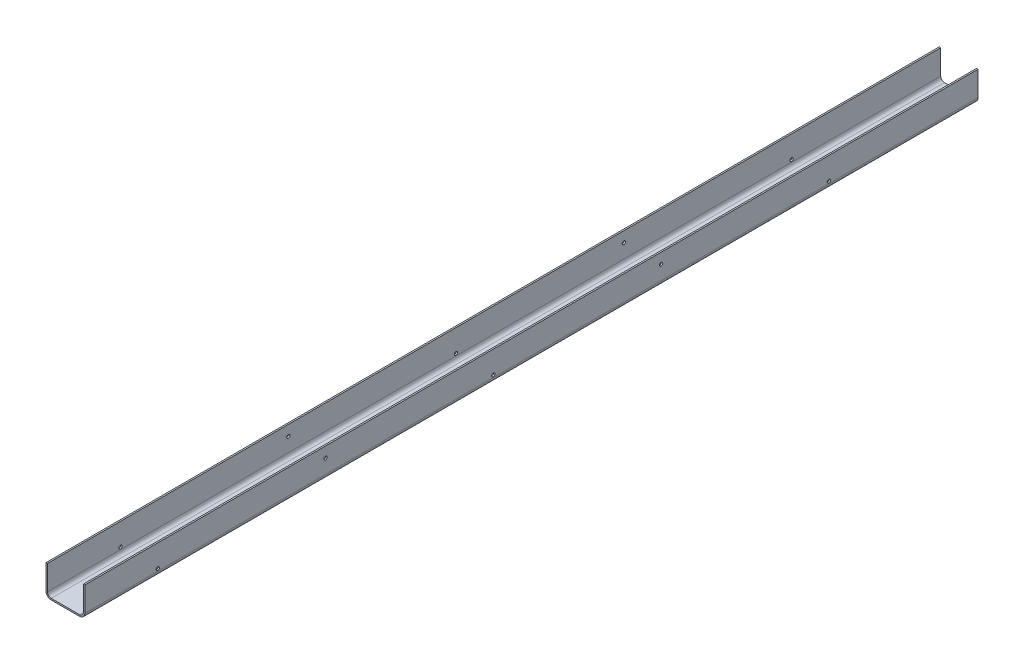
ISO-10303-21;
HEADER;
FILE_DESCRIPTION(('STEP AP214'),'2;1');
FILE_NAME('part.step','',(''),(''),'','','');
FILE_SCHEMA(('AUTOMOTIVE_DESIGN { 1 0 10303 214 1 1 1 1 }'));
ENDSEC;
DATA;
#1=APPLICATION_CONTEXT('core data for automotive mechanical design processes');
#2=APPLICATION_PROTOCOL_DEFINITION('international standard','automotive_design',2000,#1);
#3=PRODUCT_CONTEXT('',#1,'mechanical');
#4=PRODUCT('Part','Part','',(#3));
#5=PRODUCT_RELATED_PRODUCT_CATEGORY('part','',(#4));
#6=PRODUCT_DEFINITION_FORMATION('','',#4);
#7=PRODUCT_DEFINITION_CONTEXT('part definition',#1,'design');
#8=PRODUCT_DEFINITION('design','',#6,#7);
#9=PRODUCT_DEFINITION_SHAPE('','',#8);
#10=(LENGTH_UNIT() NAMED_UNIT(*) SI_UNIT(.MILLI.,.METRE.));
#11=(NAMED_UNIT(*) PLANE_ANGLE_UNIT() SI_UNIT($,.RADIAN.));
#12=(NAMED_UNIT(*) SI_UNIT($,.STERADIAN.) SOLID_ANGLE_UNIT());
#13=UNCERTAINTY_MEASURE_WITH_UNIT(LENGTH_MEASURE(1.E-05),#10,'distance_accuracy_value','');
#14=(GEOMETRIC_REPRESENTATION_CONTEXT(3) GLOBAL_UNCERTAINTY_ASSIGNED_CONTEXT((#13)) GLOBAL_UNIT_ASSIGNED_CONTEXT((#10,
#11,#12)) REPRESENTATION_CONTEXT('',''));
#15=CARTESIAN_POINT('',(0.,0.,0.));
#16=DIRECTION('',(0.,0.,1.));
#17=DIRECTION('',(1.,0.,0.));
#18=AXIS2_PLACEMENT_3D('',#15,#16,#17);
#19=CARTESIAN_POINT('',(0.,-165.,0.));
#20=DIRECTION('',(0.,0.,-1.));
#21=DIRECTION('',(-1.,0.,0.));
#22=AXIS2_PLACEMENT_3D('',#19,#20,#21);
#23=PLANE('',#22);
#24=DIRECTION('',(-1.,0.,0.));
#25=VECTOR('',#24,1.);
#26=CARTESIAN_POINT('',(0.,-165.,0.));
#27=LINE('',#26,#25);
#28=CARTESIAN_POINT('',(0.,-165.,0.));
#29=VERTEX_POINT('',#28);
#30=CARTESIAN_POINT('',(-10.,-165.,0.));
#31=VERTEX_POINT('',#30);
#32=EDGE_CURVE('E46',#29,#31,#27,.T.);
#33=ORIENTED_EDGE('',*,*,#32,.F.);
#34=CARTESIAN_POINT('',(25.,-165.,0.));
#35=DIRECTION('',(0.,0.,-1.));
#36=DIRECTION('',(-1.,0.,0.));
#37=AXIS2_PLACEMENT_3D('',#34,#35,#36);
#38=CIRCLE('',#37,25.);
#39=CARTESIAN_POINT('',(25.,-190.,0.));
#40=VERTEX_POINT('',#39);
#41=EDGE_CURVE('E288',#29,#40,#38,.F.);
#42=ORIENTED_EDGE('',*,*,#41,.T.);
#43=DIRECTION('',(0.,1.,0.));
#44=VECTOR('',#43,1.);
#45=CARTESIAN_POINT('',(25.,-200.,0.));
#46=LINE('',#45,#44);
#47=CARTESIAN_POINT('',(25.,-200.,0.));
#48=VERTEX_POINT('',#47);
#49=EDGE_CURVE('E176',#48,#40,#46,.T.);
#50=ORIENTED_EDGE('',*,*,#49,.F.);
#51=CARTESIAN_POINT('',(25.,-165.,0.));
#52=DIRECTION('',(0.,0.,1.));
#53=DIRECTION('',(1.,0.,0.));
#54=AXIS2_PLACEMENT_3D('',#51,#52,#53);
#55=CIRCLE('',#54,35.);
#56=EDGE_CURVE('E190',#31,#48,#55,.T.);
#57=ORIENTED_EDGE('',*,*,#56,.F.);
#58=EDGE_LOOP('',(#33,#42,#50,#57));
#59=FACE_BOUND('',#58,.T.);
#60=ADVANCED_FACE('F39',(#59),#23,.T.);
#61=CARTESIAN_POINT('',(25.,-200.,0.));
#62=DIRECTION('',(0.,0.,-1.));
#63=DIRECTION('',(-1.,0.,0.));
#64=AXIS2_PLACEMENT_3D('',#61,#62,#63);
#65=PLANE('',#64);
#66=DIRECTION('',(0.,-1.,0.));
#67=VECTOR('',#66,1.);
#68=CARTESIAN_POINT('',(0.,0.,0.));
#69=LINE('',#68,#67);
#70=CARTESIAN_POINT('',(0.,0.,0.));
#71=VERTEX_POINT('',#70);
#72=EDGE_CURVE('E185',#71,#29,#69,.T.);
#73=ORIENTED_EDGE('',*,*,#72,.T.);
#74=ORIENTED_EDGE('',*,*,#32,.T.);
#75=DIRECTION('',(0.,1.,0.));
#76=VECTOR('',#75,1.);
#77=CARTESIAN_POINT('',(-10.,0.,0.));
#78=LINE('',#77,#76);
#79=CARTESIAN_POINT('',(-10.,0.,0.));
#80=VERTEX_POINT('',#79);
#81=EDGE_CURVE('E183',#80,#31,#78,.F.);
#82=ORIENTED_EDGE('',*,*,#81,.F.);
#83=DIRECTION('',(1.,0.,0.));
#84=VECTOR('',#83,1.);
#85=CARTESIAN_POINT('',(-10.,0.,0.));
#86=LINE('',#85,#84);
#87=EDGE_CURVE('E150',#80,#71,#86,.T.);
#88=ORIENTED_EDGE('',*,*,#87,.T.);
#89=EDGE_LOOP('',(#73,#74,#82,#88));
#90=FACE_BOUND('',#89,.T.);
#91=ADVANCED_FACE('F182',(#90),#65,.T.);
#92=CARTESIAN_POINT('',(215.,-190.,0.));
#93=DIRECTION('',(0.,0.,-1.));
#94=DIRECTION('',(-1.,0.,0.));
#95=AXIS2_PLACEMENT_3D('',#92,#93,#94);
#96=PLANE('',#95);
#97=DIRECTION('',(0.,-1.,0.));
#98=VECTOR('',#97,1.);
#99=CARTESIAN_POINT('',(215.,-190.,0.));
#100=LINE('',#99,#98);
#101=CARTESIAN_POINT('',(215.,-190.,0.));
#102=VERTEX_POINT('',#101);
#103=CARTESIAN_POINT('',(215.,-200.,0.));
#104=VERTEX_POINT('',#103);
#105=EDGE_CURVE('E173',#102,#104,#100,.T.);
#106=ORIENTED_EDGE('',*,*,#105,.F.);
#107=CARTESIAN_POINT('',(215.,-165.,0.));
#108=DIRECTION('',(0.,0.,-1.));
#109=DIRECTION('',(-1.,0.,0.));
#110=AXIS2_PLACEMENT_3D('',#107,#108,#109);
#111=CIRCLE('',#110,25.);
#112=CARTESIAN_POINT('',(240.,-165.,0.));
#113=VERTEX_POINT('',#112);
#114=EDGE_CURVE('E282',#102,#113,#111,.F.);
#115=ORIENTED_EDGE('',*,*,#114,.T.);
#116=DIRECTION('',(-1.,0.,0.));
#117=VECTOR('',#116,1.);
#118=CARTESIAN_POINT('',(250.,-165.,0.));
#119=LINE('',#118,#117);
#120=CARTESIAN_POINT('',(250.,-165.,0.));
#121=VERTEX_POINT('',#120);
#122=EDGE_CURVE('E170',#121,#113,#119,.T.);
#123=ORIENTED_EDGE('',*,*,#122,.F.);
#124=CARTESIAN_POINT('',(215.,-165.,0.));
#125=DIRECTION('',(0.,0.,1.));
#126=DIRECTION('',(1.,0.,0.));
#127=AXIS2_PLACEMENT_3D('',#124,#125,#126);
#128=CIRCLE('',#127,35.);
#129=EDGE_CURVE('E200',#104,#121,#128,.T.);
#130=ORIENTED_EDGE('',*,*,#129,.F.);
#131=EDGE_LOOP('',(#106,#115,#123,#130));
#132=FACE_BOUND('',#131,.T.);
#133=ADVANCED_FACE('F307',(#132),#96,.T.);
#134=CARTESIAN_POINT('',(250.,-165.,0.));
#135=DIRECTION('',(0.,0.,-1.));
#136=DIRECTION('',(-1.,0.,0.));
#137=AXIS2_PLACEMENT_3D('',#134,#135,#136);
#138=PLANE('',#137);
#139=DIRECTION('',(1.,0.,0.));
#140=VECTOR('',#139,1.);
#141=CARTESIAN_POINT('',(0.,-190.,0.));
#142=LINE('',#141,#140);
#143=EDGE_CURVE('E285',#40,#102,#142,.T.);
#144=ORIENTED_EDGE('',*,*,#143,.T.);
#145=ORIENTED_EDGE('',*,*,#105,.T.);
#146=DIRECTION('',(1.,0.,0.));
#147=VECTOR('',#146,1.);
#148=CARTESIAN_POINT('',(0.,-200.,0.));
#149=LINE('',#148,#147);
#150=EDGE_CURVE('E197',#48,#104,#149,.T.);
#151=ORIENTED_EDGE('',*,*,#150,.F.);
#152=ORIENTED_EDGE('',*,*,#49,.T.);
#153=EDGE_LOOP('',(#144,#145,#151,#152));
#154=FACE_BOUND('',#153,.T.);
#155=ADVANCED_FACE('F299',(#154),#138,.T.);
#156=CARTESIAN_POINT('',(250.,-190.,6500.));
#157=DIRECTION('',(-1.,0.,0.));
#158=DIRECTION('',(0.,0.,1.));
#159=AXIS2_PLACEMENT_3D('',#156,#157,#158);
#160=PLANE('',#159);
#161=CARTESIAN_POINT('',(250.,-150.,1000.));
#162=DIRECTION('',(-1.,0.,0.));
#163=DIRECTION('',(0.,0.,1.));
#164=AXIS2_PLACEMENT_3D('',#161,#162,#163);
#165=CIRCLE('',#164,11.);
#166=CARTESIAN_POINT('',(250.,-150.,1011.));
#167=VERTEX_POINT('',#166);
#168=EDGE_CURVE('E271',#167,#167,#165,.T.);
#169=ORIENTED_EDGE('',*,*,#168,.T.);
#170=EDGE_LOOP('',(#169));
#171=FACE_BOUND('',#170,.T.);
#172=CARTESIAN_POINT('',(250.,-150.,3250.));
#173=DIRECTION('',(-1.,0.,0.));
#174=DIRECTION('',(0.,0.,1.));
#175=AXIS2_PLACEMENT_3D('',#172,#173,#174);
#176=CIRCLE('',#175,11.0000000000001);
#177=CARTESIAN_POINT('',(250.,-150.,3261.));
#178=VERTEX_POINT('',#177);
#179=EDGE_CURVE('E262',#178,#178,#176,.T.);
#180=ORIENTED_EDGE('',*,*,#179,.T.);
#181=EDGE_LOOP('',(#180));
#182=FACE_BOUND('',#181,.T.);
#183=CARTESIAN_POINT('',(250.,-150.,5500.));
#184=DIRECTION('',(-1.,0.,0.));
#185=DIRECTION('',(0.,0.,1.));
#186=AXIS2_PLACEMENT_3D('',#183,#184,#185);
#187=CIRCLE('',#186,10.9999999999997);
#188=CARTESIAN_POINT('',(250.,-150.,5511.));
#189=VERTEX_POINT('',#188);
#190=EDGE_CURVE('E253',#189,#189,#187,.T.);
#191=ORIENTED_EDGE('',*,*,#190,.T.);
#192=EDGE_LOOP('',(#191));
#193=FACE_BOUND('',#192,.T.);
#194=CARTESIAN_POINT('',(250.,-70.,2125.));
#195=DIRECTION('',(-1.,0.,0.));
#196=DIRECTION('',(0.,0.,1.));
#197=AXIS2_PLACEMENT_3D('',#194,#195,#196);
#198=CIRCLE('',#197,11.0000000000001);
#199=CARTESIAN_POINT('',(250.,-70.,2136.));
#200=VERTEX_POINT('',#199);
#201=EDGE_CURVE('E244',#200,#200,#198,.T.);
#202=ORIENTED_EDGE('',*,*,#201,.T.);
#203=EDGE_LOOP('',(#202));
#204=FACE_BOUND('',#203,.T.);
#205=CARTESIAN_POINT('',(250.,-70.,4375.));
#206=DIRECTION('',(-1.,0.,0.));
#207=DIRECTION('',(0.,0.,1.));
#208=AXIS2_PLACEMENT_3D('',#205,#206,#207);
#209=CIRCLE('',#208,10.9999999999997);
#210=CARTESIAN_POINT('',(250.,-70.,4386.));
#211=VERTEX_POINT('',#210);
#212=EDGE_CURVE('E235',#211,#211,#209,.T.);
#213=ORIENTED_EDGE('',*,*,#212,.T.);
#214=EDGE_LOOP('',(#213));
#215=FACE_BOUND('',#214,.T.);
#216=DIRECTION('',(0.,0.,-1.));
#217=VECTOR('',#216,1.);
#218=CARTESIAN_POINT('',(250.,0.,6500.));
#219=LINE('',#218,#217);
#220=CARTESIAN_POINT('',(250.,0.,5990.));
#221=VERTEX_POINT('',#220);
#222=CARTESIAN_POINT('',(250.,0.,0.));
#223=VERTEX_POINT('',#222);
#224=EDGE_CURVE('E168',#221,#223,#219,.T.);
#225=ORIENTED_EDGE('',*,*,#224,.F.);
#226=DIRECTION('',(0.,-1.,0.));
#227=VECTOR('',#226,1.);
#228=CARTESIAN_POINT('',(250.,-190.,5990.));
#229=LINE('',#228,#227);
#230=CARTESIAN_POINT('',(250.,-165.,5990.));
#231=VERTEX_POINT('',#230);
#232=EDGE_CURVE('E214',#221,#231,#229,.T.);
#233=ORIENTED_EDGE('',*,*,#232,.T.);
#234=DIRECTION('',(0.,0.,-1.));
#235=VECTOR('',#234,1.);
#236=CARTESIAN_POINT('',(250.,-165.,6500.));
#237=LINE('',#236,#235);
#238=EDGE_CURVE('E60',#231,#121,#237,.T.);
#239=ORIENTED_EDGE('',*,*,#238,.T.);
#240=DIRECTION('',(0.,1.,0.));
#241=VECTOR('',#240,1.);
#242=CARTESIAN_POINT('',(250.,-190.,0.));
#243=LINE('',#242,#241);
#244=EDGE_CURVE('E274',#121,#223,#243,.T.);
#245=ORIENTED_EDGE('',*,*,#244,.T.);
#246=EDGE_LOOP('',(#225,#233,#239,#245));
#247=FACE_BOUND('',#246,.T.);
#248=ADVANCED_FACE('F323',(#171,#182,#193,#204,#215,#247),#160,.F.);
#249=CARTESIAN_POINT('',(240.,0.,6500.));
#250=DIRECTION('',(0.,1.,0.));
#251=DIRECTION('',(0.,0.,1.));
#252=AXIS2_PLACEMENT_3D('',#249,#250,#251);
#253=PLANE('',#252);
#254=DIRECTION('',(1.,0.,0.));
#255=VECTOR('',#254,1.);
#256=CARTESIAN_POINT('',(-10.,0.,5990.));
#257=LINE('',#256,#255);
#258=CARTESIAN_POINT('',(240.,0.,5990.));
#259=VERTEX_POINT('',#258);
#260=EDGE_CURVE('E137',#259,#221,#257,.T.);
#261=ORIENTED_EDGE('',*,*,#260,.T.);
#262=ORIENTED_EDGE('',*,*,#224,.T.);
#263=DIRECTION('',(1.,0.,0.));
#264=VECTOR('',#263,1.);
#265=CARTESIAN_POINT('',(240.,0.,0.));
#266=LINE('',#265,#264);
#267=CARTESIAN_POINT('',(240.,0.,0.));
#268=VERTEX_POINT('',#267);
#269=EDGE_CURVE('E276',#268,#223,#266,.T.);
#270=ORIENTED_EDGE('',*,*,#269,.F.);
#271=DIRECTION('',(0.,0.,-1.));
#272=VECTOR('',#271,1.);
#273=CARTESIAN_POINT('',(240.,0.,6500.));
#274=LINE('',#273,#272);
#275=EDGE_CURVE('E166',#259,#268,#274,.T.);
#276=ORIENTED_EDGE('',*,*,#275,.F.);
#277=EDGE_LOOP('',(#261,#262,#270,#276));
#278=FACE_BOUND('',#277,.T.);
#279=ADVANCED_FACE('F321',(#278),#253,.T.);
#280=CARTESIAN_POINT('',(240.,-190.,6500.));
#281=DIRECTION('',(-1.,0.,0.));
#282=DIRECTION('',(0.,0.,1.));
#283=AXIS2_PLACEMENT_3D('',#280,#281,#282);
#284=PLANE('',#283);
#285=CARTESIAN_POINT('',(240.,-150.,1000.));
#286=DIRECTION('',(-1.,0.,0.));
#287=DIRECTION('',(0.,0.,1.));
#288=AXIS2_PLACEMENT_3D('',#285,#286,#287);
#289=CIRCLE('',#288,11.);
#290=CARTESIAN_POINT('',(240.,-150.,1011.));
#291=VERTEX_POINT('',#290);
#292=EDGE_CURVE('E268',#291,#291,#289,.T.);
#293=ORIENTED_EDGE('',*,*,#292,.F.);
#294=EDGE_LOOP('',(#293));
#295=FACE_BOUND('',#294,.T.);
#296=CARTESIAN_POINT('',(240.,-150.,3250.));
#297=DIRECTION('',(-1.,0.,0.));
#298=DIRECTION('',(0.,0.,1.));
#299=AXIS2_PLACEMENT_3D('',#296,#297,#298);
#300=CIRCLE('',#299,11.0000000000001);
#301=CARTESIAN_POINT('',(240.,-150.,3261.));
#302=VERTEX_POINT('',#301);
#303=EDGE_CURVE('E259',#302,#302,#300,.T.);
#304=ORIENTED_EDGE('',*,*,#303,.F.);
#305=EDGE_LOOP('',(#304));
#306=FACE_BOUND('',#305,.T.);
#307=CARTESIAN_POINT('',(240.,-150.,5500.));
#308=DIRECTION('',(-1.,0.,0.));
#309=DIRECTION('',(0.,0.,1.));
#310=AXIS2_PLACEMENT_3D('',#307,#308,#309);
#311=CIRCLE('',#310,10.9999999999997);
#312=CARTESIAN_POINT('',(240.,-150.,5511.));
#313=VERTEX_POINT('',#312);
#314=EDGE_CURVE('E250',#313,#313,#311,.T.);
#315=ORIENTED_EDGE('',*,*,#314,.F.);
#316=EDGE_LOOP('',(#315));
#317=FACE_BOUND('',#316,.T.);
#318=CARTESIAN_POINT('',(240.,-70.,2125.));
#319=DIRECTION('',(-1.,0.,0.));
#320=DIRECTION('',(0.,0.,1.));
#321=AXIS2_PLACEMENT_3D('',#318,#319,#320);
#322=CIRCLE('',#321,11.0000000000001);
#323=CARTESIAN_POINT('',(240.,-70.,2136.));
#324=VERTEX_POINT('',#323);
#325=EDGE_CURVE('E241',#324,#324,#322,.T.);
#326=ORIENTED_EDGE('',*,*,#325,.F.);
#327=EDGE_LOOP('',(#326));
#328=FACE_BOUND('',#327,.T.);
#329=CARTESIAN_POINT('',(240.,-70.,4375.));
#330=DIRECTION('',(-1.,0.,0.));
#331=DIRECTION('',(0.,0.,1.));
#332=AXIS2_PLACEMENT_3D('',#329,#330,#331);
#333=CIRCLE('',#332,10.9999999999997);
#334=CARTESIAN_POINT('',(240.,-70.,4386.));
#335=VERTEX_POINT('',#334);
#336=EDGE_CURVE('E232',#335,#335,#333,.T.);
#337=ORIENTED_EDGE('',*,*,#336,.F.);
#338=EDGE_LOOP('',(#337));
#339=FACE_BOUND('',#338,.T.);
#340=DIRECTION('',(0.,-1.,0.));
#341=VECTOR('',#340,1.);
#342=CARTESIAN_POINT('',(240.,-190.,5990.));
#343=LINE('',#342,#341);
#344=CARTESIAN_POINT('',(240.,-165.,5990.));
#345=VERTEX_POINT('',#344);
#346=EDGE_CURVE('E227',#259,#345,#343,.T.);
#347=ORIENTED_EDGE('',*,*,#346,.F.);
#348=ORIENTED_EDGE('',*,*,#275,.T.);
#349=DIRECTION('',(0.,1.,0.));
#350=VECTOR('',#349,1.);
#351=CARTESIAN_POINT('',(240.,-190.,0.));
#352=LINE('',#351,#350);
#353=EDGE_CURVE('E279',#113,#268,#352,.T.);
#354=ORIENTED_EDGE('',*,*,#353,.F.);
#355=DIRECTION('',(0.,0.,-1.));
#356=VECTOR('',#355,1.);
#357=CARTESIAN_POINT('',(240.,-165.,6500.));
#358=LINE('',#357,#356);
#359=EDGE_CURVE('E164',#345,#113,#358,.T.);
#360=ORIENTED_EDGE('',*,*,#359,.F.);
#361=EDGE_LOOP('',(#347,#348,#354,#360));
#362=FACE_BOUND('',#361,.T.);
#363=ADVANCED_FACE('F316',(#295,#306,#317,#328,#339,#362),#284,.T.);
#364=CARTESIAN_POINT('',(215.,-165.,6500.));
#365=DIRECTION('',(0.,0.,-1.));
#366=DIRECTION('',(-1.,0.,0.));
#367=AXIS2_PLACEMENT_3D('',#364,#365,#366);
#368=CYLINDRICAL_SURFACE('',#367,25.);
#369=CARTESIAN_POINT('',(215.,-165.,5990.));
#370=DIRECTION('',(0.,0.,-1.));
#371=DIRECTION('',(-1.,0.,0.));
#372=AXIS2_PLACEMENT_3D('',#369,#370,#371);
#373=CIRCLE('',#372,25.);
#374=CARTESIAN_POINT('',(215.,-190.,5990.));
#375=VERTEX_POINT('',#374);
#376=EDGE_CURVE('E225',#345,#375,#373,.T.);
#377=ORIENTED_EDGE('',*,*,#376,.F.);
#378=ORIENTED_EDGE('',*,*,#359,.T.);
#379=ORIENTED_EDGE('',*,*,#114,.F.);
#380=DIRECTION('',(0.,0.,-1.));
#381=VECTOR('',#380,1.);
#382=CARTESIAN_POINT('',(215.,-190.,6500.));
#383=LINE('',#382,#381);
#384=EDGE_CURVE('E162',#375,#102,#383,.T.);
#385=ORIENTED_EDGE('',*,*,#384,.F.);
#386=EDGE_LOOP('',(#377,#378,#379,#385));
#387=FACE_BOUND('',#386,.T.);
#388=ADVANCED_FACE('F308',(#387),#368,.F.);
#389=CARTESIAN_POINT('',(0.,-190.,6500.));
#390=DIRECTION('',(0.,1.,0.));
#391=DIRECTION('',(0.,0.,1.));
#392=AXIS2_PLACEMENT_3D('',#389,#390,#391);
#393=PLANE('',#392);
#394=DIRECTION('',(-1.,0.,0.));
#395=VECTOR('',#394,1.);
#396=CARTESIAN_POINT('',(0.,-190.,5990.));
#397=LINE('',#396,#395);
#398=CARTESIAN_POINT('',(25.,-190.,5990.));
#399=VERTEX_POINT('',#398);
#400=EDGE_CURVE('E223',#375,#399,#397,.T.);
#401=ORIENTED_EDGE('',*,*,#400,.F.);
#402=ORIENTED_EDGE('',*,*,#384,.T.);
#403=ORIENTED_EDGE('',*,*,#143,.F.);
#404=DIRECTION('',(0.,0.,-1.));
#405=VECTOR('',#404,1.);
#406=CARTESIAN_POINT('',(25.,-190.,6500.));
#407=LINE('',#406,#405);
#408=EDGE_CURVE('E160',#399,#40,#407,.T.);
#409=ORIENTED_EDGE('',*,*,#408,.F.);
#410=EDGE_LOOP('',(#401,#402,#403,#409));
#411=FACE_BOUND('',#410,.T.);
#412=ADVANCED_FACE('F300',(#411),#393,.T.);
#413=CARTESIAN_POINT('',(25.,-165.,6500.));
#414=DIRECTION('',(0.,0.,-1.));
#415=DIRECTION('',(-1.,0.,0.));
#416=AXIS2_PLACEMENT_3D('',#413,#414,#415);
#417=CYLINDRICAL_SURFACE('',#416,25.);
#418=CARTESIAN_POINT('',(25.,-165.,5990.));
#419=DIRECTION('',(0.,0.,-1.));
#420=DIRECTION('',(-1.,0.,0.));
#421=AXIS2_PLACEMENT_3D('',#418,#419,#420);
#422=CIRCLE('',#421,25.);
#423=CARTESIAN_POINT('',(0.,-165.,5990.));
#424=VERTEX_POINT('',#423);
#425=EDGE_CURVE('E216',#399,#424,#422,.T.);
#426=ORIENTED_EDGE('',*,*,#425,.F.);
#427=ORIENTED_EDGE('',*,*,#408,.T.);
#428=ORIENTED_EDGE('',*,*,#41,.F.);
#429=DIRECTION('',(0.,0.,-1.));
#430=VECTOR('',#429,1.);
#431=CARTESIAN_POINT('',(0.,-165.,6500.));
#432=LINE('',#431,#430);
#433=EDGE_CURVE('E153',#424,#29,#432,.T.);
#434=ORIENTED_EDGE('',*,*,#433,.F.);
#435=EDGE_LOOP('',(#426,#427,#428,#434));
#436=FACE_BOUND('',#435,.T.);
#437=ADVANCED_FACE('F293',(#436),#417,.F.);
#438=CARTESIAN_POINT('',(0.,0.,6500.));
#439=DIRECTION('',(1.,0.,0.));
#440=DIRECTION('',(0.,0.,-1.));
#441=AXIS2_PLACEMENT_3D('',#438,#439,#440);
#442=PLANE('',#441);
#443=CARTESIAN_POINT('',(0.,-150.,1000.));
#444=DIRECTION('',(1.,0.,0.));
#445=DIRECTION('',(0.,0.,-1.));
#446=AXIS2_PLACEMENT_3D('',#443,#444,#445);
#447=CIRCLE('',#446,11.);
#448=CARTESIAN_POINT('',(0.,-150.,989.));
#449=VERTEX_POINT('',#448);
#450=EDGE_CURVE('E265',#449,#449,#447,.T.);
#451=ORIENTED_EDGE('',*,*,#450,.F.);
#452=EDGE_LOOP('',(#451));
#453=FACE_BOUND('',#452,.T.);
#454=CARTESIAN_POINT('',(0.,-150.,3250.));
#455=DIRECTION('',(1.,0.,0.));
#456=DIRECTION('',(0.,0.,-1.));
#457=AXIS2_PLACEMENT_3D('',#454,#455,#456);
#458=CIRCLE('',#457,11.0000000000001);
#459=CARTESIAN_POINT('',(0.,-150.,3239.));
#460=VERTEX_POINT('',#459);
#461=EDGE_CURVE('E256',#460,#460,#458,.T.);
#462=ORIENTED_EDGE('',*,*,#461,.F.);
#463=EDGE_LOOP('',(#462));
#464=FACE_BOUND('',#463,.T.);
#465=CARTESIAN_POINT('',(0.,-150.,5500.));
#466=DIRECTION('',(1.,0.,0.));
#467=DIRECTION('',(0.,0.,-1.));
#468=AXIS2_PLACEMENT_3D('',#465,#466,#467);
#469=CIRCLE('',#468,10.9999999999997);
#470=CARTESIAN_POINT('',(0.,-150.,5489.));
#471=VERTEX_POINT('',#470);
#472=EDGE_CURVE('E247',#471,#471,#469,.T.);
#473=ORIENTED_EDGE('',*,*,#472,.F.);
#474=EDGE_LOOP('',(#473));
#475=FACE_BOUND('',#474,.T.);
#476=CARTESIAN_POINT('',(0.,-70.,2125.));
#477=DIRECTION('',(1.,0.,0.));
#478=DIRECTION('',(0.,0.,-1.));
#479=AXIS2_PLACEMENT_3D('',#476,#477,#478);
#480=CIRCLE('',#479,11.0000000000001);
#481=CARTESIAN_POINT('',(0.,-70.,2114.));
#482=VERTEX_POINT('',#481);
#483=EDGE_CURVE('E238',#482,#482,#480,.T.);
#484=ORIENTED_EDGE('',*,*,#483,.F.);
#485=EDGE_LOOP('',(#484));
#486=FACE_BOUND('',#485,.T.);
#487=CARTESIAN_POINT('',(0.,-70.,4375.));
#488=DIRECTION('',(1.,0.,0.));
#489=DIRECTION('',(0.,0.,-1.));
#490=AXIS2_PLACEMENT_3D('',#487,#488,#489);
#491=CIRCLE('',#490,10.9999999999997);
#492=CARTESIAN_POINT('',(0.,-70.,4364.));
#493=VERTEX_POINT('',#492);
#494=EDGE_CURVE('E229',#493,#493,#491,.T.);
#495=ORIENTED_EDGE('',*,*,#494,.F.);
#496=EDGE_LOOP('',(#495));
#497=FACE_BOUND('',#496,.T.);
#498=DIRECTION('',(0.,1.,0.));
#499=VECTOR('',#498,1.);
#500=CARTESIAN_POINT('',(0.,0.,5990.));
#501=LINE('',#500,#499);
#502=CARTESIAN_POINT('',(0.,0.,5990.));
#503=VERTEX_POINT('',#502);
#504=EDGE_CURVE('E132',#424,#503,#501,.T.);
#505=ORIENTED_EDGE('',*,*,#504,.F.);
#506=ORIENTED_EDGE('',*,*,#433,.T.);
#507=ORIENTED_EDGE('',*,*,#72,.F.);
#508=DIRECTION('',(0.,0.,-1.));
#509=VECTOR('',#508,1.);
#510=CARTESIAN_POINT('',(0.,0.,6500.));
#511=LINE('',#510,#509);
#512=EDGE_CURVE('E151',#503,#71,#511,.T.);
#513=ORIENTED_EDGE('',*,*,#512,.F.);
#514=EDGE_LOOP('',(#505,#506,#507,#513));
#515=FACE_BOUND('',#514,.T.);
#516=ADVANCED_FACE('F396',(#453,#464,#475,#486,#497,#515),#442,.T.);
#517=CARTESIAN_POINT('',(-10.,0.,6500.));
#518=DIRECTION('',(0.,1.,0.));
#519=DIRECTION('',(0.,0.,1.));
#520=AXIS2_PLACEMENT_3D('',#517,#518,#519);
#521=PLANE('',#520);
#522=CARTESIAN_POINT('',(-10.,0.,5990.));
#523=VERTEX_POINT('',#522);
#524=EDGE_CURVE('E126',#523,#503,#257,.T.);
#525=ORIENTED_EDGE('',*,*,#524,.T.);
#526=ORIENTED_EDGE('',*,*,#512,.T.);
#527=ORIENTED_EDGE('',*,*,#87,.F.);
#528=DIRECTION('',(0.,0.,-1.));
#529=VECTOR('',#528,1.);
#530=CARTESIAN_POINT('',(-10.,0.,6500.));
#531=LINE('',#530,#529);
#532=EDGE_CURVE('E143',#523,#80,#531,.T.);
#533=ORIENTED_EDGE('',*,*,#532,.F.);
#534=EDGE_LOOP('',(#525,#526,#527,#533));
#535=FACE_BOUND('',#534,.T.);
#536=ADVANCED_FACE('F148',(#535),#521,.T.);
#537=CARTESIAN_POINT('',(-10.,0.,6500.));
#538=DIRECTION('',(1.,0.,0.));
#539=DIRECTION('',(0.,0.,-1.));
#540=AXIS2_PLACEMENT_3D('',#537,#538,#539);
#541=PLANE('',#540);
#542=CARTESIAN_POINT('',(-10.,-150.,1000.));
#543=DIRECTION('',(1.,0.,0.));
#544=DIRECTION('',(0.,0.,-1.));
#545=AXIS2_PLACEMENT_3D('',#542,#543,#544);
#546=CIRCLE('',#545,11.);
#547=CARTESIAN_POINT('',(-10.,-150.,989.));
#548=VERTEX_POINT('',#547);
#549=EDGE_CURVE('E218',#548,#548,#546,.T.);
#550=ORIENTED_EDGE('',*,*,#549,.T.);
#551=EDGE_LOOP('',(#550));
#552=FACE_BOUND('',#551,.T.);
#553=CARTESIAN_POINT('',(-10.,-150.,3250.));
#554=DIRECTION('',(1.,0.,0.));
#555=DIRECTION('',(0.,0.,-1.));
#556=AXIS2_PLACEMENT_3D('',#553,#554,#555);
#557=CIRCLE('',#556,11.0000000000001);
#558=CARTESIAN_POINT('',(-10.,-150.,3239.));
#559=VERTEX_POINT('',#558);
#560=EDGE_CURVE('E629',#559,#559,#557,.T.);
#561=ORIENTED_EDGE('',*,*,#560,.T.);
#562=EDGE_LOOP('',(#561));
#563=FACE_BOUND('',#562,.T.);
#564=CARTESIAN_POINT('',(-10.,-150.,5500.));
#565=DIRECTION('',(1.,0.,0.));
#566=DIRECTION('',(0.,0.,-1.));
#567=AXIS2_PLACEMENT_3D('',#564,#565,#566);
#568=CIRCLE('',#567,10.9999999999997);
#569=CARTESIAN_POINT('',(-10.,-150.,5489.));
#570=VERTEX_POINT('',#569);
#571=EDGE_CURVE('E632',#570,#570,#568,.T.);
#572=ORIENTED_EDGE('',*,*,#571,.T.);
#573=EDGE_LOOP('',(#572));
#574=FACE_BOUND('',#573,.T.);
#575=CARTESIAN_POINT('',(-10.,-70.,2125.));
#576=DIRECTION('',(1.,0.,0.));
#577=DIRECTION('',(0.,0.,-1.));
#578=AXIS2_PLACEMENT_3D('',#575,#576,#577);
#579=CIRCLE('',#578,11.0000000000001);
#580=CARTESIAN_POINT('',(-10.,-70.,2114.));
#581=VERTEX_POINT('',#580);
#582=EDGE_CURVE('E637',#581,#581,#579,.T.);
#583=ORIENTED_EDGE('',*,*,#582,.T.);
#584=EDGE_LOOP('',(#583));
#585=FACE_BOUND('',#584,.T.);
#586=CARTESIAN_POINT('',(-10.,-70.,4375.));
#587=DIRECTION('',(1.,0.,0.));
#588=DIRECTION('',(0.,0.,-1.));
#589=AXIS2_PLACEMENT_3D('',#586,#587,#588);
#590=CIRCLE('',#589,10.9999999999997);
#591=CARTESIAN_POINT('',(-10.,-70.,4364.));
#592=VERTEX_POINT('',#591);
#593=EDGE_CURVE('E136',#592,#592,#590,.T.);
#594=ORIENTED_EDGE('',*,*,#593,.T.);
#595=EDGE_LOOP('',(#594));
#596=FACE_BOUND('',#595,.T.);
#597=DIRECTION('',(0.,0.,-1.));
#598=VECTOR('',#597,1.);
#599=CARTESIAN_POINT('',(-10.,-165.,6500.));
#600=LINE('',#599,#598);
#601=CARTESIAN_POINT('',(-10.,-165.,5990.));
#602=VERTEX_POINT('',#601);
#603=EDGE_CURVE('E145',#602,#31,#600,.T.);
#604=ORIENTED_EDGE('',*,*,#603,.F.);
#605=DIRECTION('',(0.,1.,0.));
#606=VECTOR('',#605,1.);
#607=CARTESIAN_POINT('',(-10.,0.,5990.));
#608=LINE('',#607,#606);
#609=EDGE_CURVE('E129',#602,#523,#608,.T.);
#610=ORIENTED_EDGE('',*,*,#609,.T.);
#611=ORIENTED_EDGE('',*,*,#532,.T.);
#612=ORIENTED_EDGE('',*,*,#81,.T.);
#613=EDGE_LOOP('',(#604,#610,#611,#612));
#614=FACE_BOUND('',#613,.T.);
#615=ADVANCED_FACE('F141',(#552,#563,#574,#585,#596,#614),#541,.F.);
#616=CARTESIAN_POINT('',(25.,-165.,6500.));
#617=DIRECTION('',(0.,0.,-1.));
#618=DIRECTION('',(-1.,0.,0.));
#619=AXIS2_PLACEMENT_3D('',#616,#617,#618);
#620=CYLINDRICAL_SURFACE('',#619,35.);
#621=DIRECTION('',(0.,0.,-1.));
#622=VECTOR('',#621,1.);
#623=CARTESIAN_POINT('',(25.,-200.,6500.));
#624=LINE('',#623,#622);
#625=CARTESIAN_POINT('',(25.,-200.,5990.));
#626=VERTEX_POINT('',#625);
#627=EDGE_CURVE('E155',#626,#48,#624,.T.);
#628=ORIENTED_EDGE('',*,*,#627,.F.);
#629=CARTESIAN_POINT('',(25.,-165.,5990.));
#630=DIRECTION('',(0.,0.,-1.));
#631=DIRECTION('',(-1.,0.,0.));
#632=AXIS2_PLACEMENT_3D('',#629,#630,#631);
#633=CIRCLE('',#632,35.);
#634=EDGE_CURVE('E213',#626,#602,#633,.T.);
#635=ORIENTED_EDGE('',*,*,#634,.T.);
#636=ORIENTED_EDGE('',*,*,#603,.T.);
#637=ORIENTED_EDGE('',*,*,#56,.T.);
#638=EDGE_LOOP('',(#628,#635,#636,#637));
#639=FACE_BOUND('',#638,.T.);
#640=ADVANCED_FACE('F212',(#639),#620,.T.);
#641=CARTESIAN_POINT('',(0.,-200.,6500.));
#642=DIRECTION('',(0.,1.,0.));
#643=DIRECTION('',(0.,0.,1.));
#644=AXIS2_PLACEMENT_3D('',#641,#642,#643);
#645=PLANE('',#644);
#646=DIRECTION('',(0.,0.,-1.));
#647=VECTOR('',#646,1.);
#648=CARTESIAN_POINT('',(215.,-200.,6500.));
#649=LINE('',#648,#647);
#650=CARTESIAN_POINT('',(215.,-200.,5990.));
#651=VERTEX_POINT('',#650);
#652=EDGE_CURVE('E207',#651,#104,#649,.T.);
#653=ORIENTED_EDGE('',*,*,#652,.F.);
#654=DIRECTION('',(1.,0.,0.));
#655=VECTOR('',#654,1.);
#656=CARTESIAN_POINT('',(-10.,-200.,5990.));
#657=LINE('',#656,#655);
#658=EDGE_CURVE('E53',#626,#651,#657,.T.);
#659=ORIENTED_EDGE('',*,*,#658,.F.);
#660=ORIENTED_EDGE('',*,*,#627,.T.);
#661=ORIENTED_EDGE('',*,*,#150,.T.);
#662=EDGE_LOOP('',(#653,#659,#660,#661));
#663=FACE_BOUND('',#662,.T.);
#664=ADVANCED_FACE('F210',(#663),#645,.F.);
#665=CARTESIAN_POINT('',(215.,-165.,6500.));
#666=DIRECTION('',(0.,0.,-1.));
#667=DIRECTION('',(-1.,0.,0.));
#668=AXIS2_PLACEMENT_3D('',#665,#666,#667);
#669=CYLINDRICAL_SURFACE('',#668,35.);
#670=ORIENTED_EDGE('',*,*,#238,.F.);
#671=CARTESIAN_POINT('',(215.,-165.,5990.));
#672=DIRECTION('',(0.,0.,-1.));
#673=DIRECTION('',(-1.,0.,0.));
#674=AXIS2_PLACEMENT_3D('',#671,#672,#673);
#675=CIRCLE('',#674,35.);
#676=EDGE_CURVE('E11',#231,#651,#675,.T.);
#677=ORIENTED_EDGE('',*,*,#676,.T.);
#678=ORIENTED_EDGE('',*,*,#652,.T.);
#679=ORIENTED_EDGE('',*,*,#129,.T.);
#680=EDGE_LOOP('',(#670,#677,#678,#679));
#681=FACE_BOUND('',#680,.T.);
#682=ADVANCED_FACE('F444',(#681),#669,.T.);
#683=CARTESIAN_POINT('',(215.,-165.,0.));
#684=DIRECTION('',(0.,0.,-1.));
#685=DIRECTION('',(-1.,0.,0.));
#686=AXIS2_PLACEMENT_3D('',#683,#684,#685);
#687=PLANE('',#686);
#688=ORIENTED_EDGE('',*,*,#244,.F.);
#689=ORIENTED_EDGE('',*,*,#122,.T.);
#690=ORIENTED_EDGE('',*,*,#353,.T.);
#691=ORIENTED_EDGE('',*,*,#269,.T.);
#692=EDGE_LOOP('',(#688,#689,#690,#691));
#693=FACE_BOUND('',#692,.T.);
#694=ADVANCED_FACE('F315',(#693),#687,.T.);
#695=CARTESIAN_POINT('',(-10.,0.,5990.));
#696=DIRECTION('',(0.,0.,-1.));
#697=DIRECTION('',(-1.,0.,0.));
#698=AXIS2_PLACEMENT_3D('',#695,#696,#697);
#699=PLANE('',#698);
#700=ORIENTED_EDGE('',*,*,#346,.T.);
#701=ORIENTED_EDGE('',*,*,#376,.T.);
#702=ORIENTED_EDGE('',*,*,#400,.T.);
#703=ORIENTED_EDGE('',*,*,#425,.T.);
#704=ORIENTED_EDGE('',*,*,#504,.T.);
#705=ORIENTED_EDGE('',*,*,#524,.F.);
#706=ORIENTED_EDGE('',*,*,#609,.F.);
#707=ORIENTED_EDGE('',*,*,#634,.F.);
#708=ORIENTED_EDGE('',*,*,#658,.T.);
#709=ORIENTED_EDGE('',*,*,#676,.F.);
#710=ORIENTED_EDGE('',*,*,#232,.F.);
#711=ORIENTED_EDGE('',*,*,#260,.F.);
#712=EDGE_LOOP('',(#700,#701,#702,#703,#704,#705,#706,#707,#708,#709,#710,#711));
#713=FACE_BOUND('',#712,.T.);
#714=ADVANCED_FACE('F128',(#713),#699,.F.);
#715=CARTESIAN_POINT('',(-10.,-70.,4375.));
#716=DIRECTION('',(1.,0.,0.));
#717=DIRECTION('',(0.,0.,-1.));
#718=AXIS2_PLACEMENT_3D('',#715,#716,#717);
#719=CYLINDRICAL_SURFACE('',#718,10.9999999999997);
#720=ORIENTED_EDGE('',*,*,#494,.T.);
#721=EDGE_LOOP('',(#720));
#722=FACE_BOUND('',#721,.T.);
#723=ORIENTED_EDGE('',*,*,#593,.F.);
#724=EDGE_LOOP('',(#723));
#725=FACE_BOUND('',#724,.T.);
#726=ADVANCED_FACE('F468',(#722,#725),#719,.F.);
#727=CARTESIAN_POINT('',(-10.,-70.,2125.));
#728=DIRECTION('',(1.,0.,0.));
#729=DIRECTION('',(0.,0.,-1.));
#730=AXIS2_PLACEMENT_3D('',#727,#728,#729);
#731=CYLINDRICAL_SURFACE('',#730,11.0000000000001);
#732=ORIENTED_EDGE('',*,*,#483,.T.);
#733=EDGE_LOOP('',(#732));
#734=FACE_BOUND('',#733,.T.);
#735=ORIENTED_EDGE('',*,*,#582,.F.);
#736=EDGE_LOOP('',(#735));
#737=FACE_BOUND('',#736,.T.);
#738=ADVANCED_FACE('F475',(#734,#737),#731,.F.);
#739=CARTESIAN_POINT('',(-10.,-150.,5500.));
#740=DIRECTION('',(1.,0.,0.));
#741=DIRECTION('',(0.,0.,-1.));
#742=AXIS2_PLACEMENT_3D('',#739,#740,#741);
#743=CYLINDRICAL_SURFACE('',#742,10.9999999999997);
#744=ORIENTED_EDGE('',*,*,#472,.T.);
#745=EDGE_LOOP('',(#744));
#746=FACE_BOUND('',#745,.T.);
#747=ORIENTED_EDGE('',*,*,#571,.F.);
#748=EDGE_LOOP('',(#747));
#749=FACE_BOUND('',#748,.T.);
#750=ADVANCED_FACE('F484',(#746,#749),#743,.F.);
#751=CARTESIAN_POINT('',(-10.,-150.,3250.));
#752=DIRECTION('',(1.,0.,0.));
#753=DIRECTION('',(0.,0.,-1.));
#754=AXIS2_PLACEMENT_3D('',#751,#752,#753);
#755=CYLINDRICAL_SURFACE('',#754,11.0000000000001);
#756=ORIENTED_EDGE('',*,*,#461,.T.);
#757=EDGE_LOOP('',(#756));
#758=FACE_BOUND('',#757,.T.);
#759=ORIENTED_EDGE('',*,*,#560,.F.);
#760=EDGE_LOOP('',(#759));
#761=FACE_BOUND('',#760,.T.);
#762=ADVANCED_FACE('F493',(#758,#761),#755,.F.);
#763=CARTESIAN_POINT('',(-10.,-150.,1000.));
#764=DIRECTION('',(1.,0.,0.));
#765=DIRECTION('',(0.,0.,-1.));
#766=AXIS2_PLACEMENT_3D('',#763,#764,#765);
#767=CYLINDRICAL_SURFACE('',#766,11.);
#768=ORIENTED_EDGE('',*,*,#450,.T.);
#769=EDGE_LOOP('',(#768));
#770=FACE_BOUND('',#769,.T.);
#771=ORIENTED_EDGE('',*,*,#549,.F.);
#772=EDGE_LOOP('',(#771));
#773=FACE_BOUND('',#772,.T.);
#774=ADVANCED_FACE('F502',(#770,#773),#767,.F.);
#775=ORIENTED_EDGE('',*,*,#336,.T.);
#776=EDGE_LOOP('',(#775));
#777=FACE_BOUND('',#776,.T.);
#778=ORIENTED_EDGE('',*,*,#212,.F.);
#779=EDGE_LOOP('',(#778));
#780=FACE_BOUND('',#779,.T.);
#781=ADVANCED_FACE('F478',(#777,#780),#719,.F.);
#782=ORIENTED_EDGE('',*,*,#325,.T.);
#783=EDGE_LOOP('',(#782));
#784=FACE_BOUND('',#783,.T.);
#785=ORIENTED_EDGE('',*,*,#201,.F.);
#786=EDGE_LOOP('',(#785));
#787=FACE_BOUND('',#786,.T.);
#788=ADVANCED_FACE('F487',(#784,#787),#731,.F.);
#789=ORIENTED_EDGE('',*,*,#314,.T.);
#790=EDGE_LOOP('',(#789));
#791=FACE_BOUND('',#790,.T.);
#792=ORIENTED_EDGE('',*,*,#190,.F.);
#793=EDGE_LOOP('',(#792));
#794=FACE_BOUND('',#793,.T.);
#795=ADVANCED_FACE('F496',(#791,#794),#743,.F.);
#796=ORIENTED_EDGE('',*,*,#303,.T.);
#797=EDGE_LOOP('',(#796));
#798=FACE_BOUND('',#797,.T.);
#799=ORIENTED_EDGE('',*,*,#179,.F.);
#800=EDGE_LOOP('',(#799));
#801=FACE_BOUND('',#800,.T.);
#802=ADVANCED_FACE('F505',(#798,#801),#755,.F.);
#803=ORIENTED_EDGE('',*,*,#292,.T.);
#804=EDGE_LOOP('',(#803));
#805=FACE_BOUND('',#804,.T.);
#806=ORIENTED_EDGE('',*,*,#168,.F.);
#807=EDGE_LOOP('',(#806));
#808=FACE_BOUND('',#807,.T.);
#809=ADVANCED_FACE('F513',(#805,#808),#767,.F.);
#810=CLOSED_SHELL('',(#60,#91,#133,#155,#248,#279,#363,#388,#412,#437,#516,#536,#615,#640,#664,
#682,#694,#714,#726,#738,#750,#762,#774,#781,#788,#795,#802,#809));
#811=MANIFOLD_SOLID_BREP('B2',#810);
#812=ADVANCED_BREP_SHAPE_REPRESENTATION('',(#18,#811),#14);
#813=SHAPE_DEFINITION_REPRESENTATION(#9,#812);
ENDSEC;
END-ISO-10303-21;
